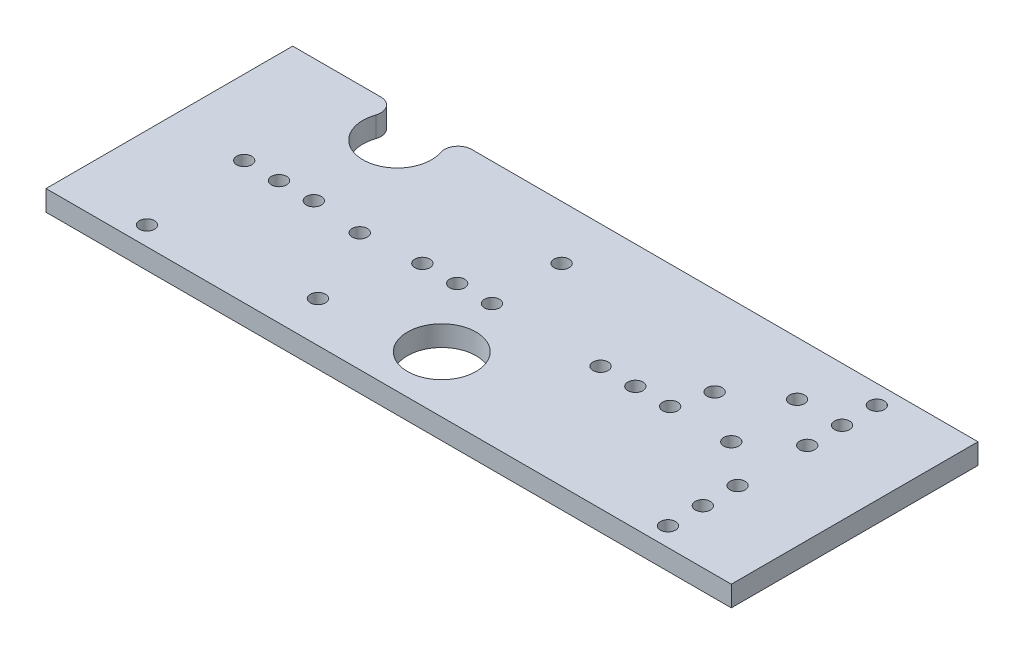
ISO-10303-21;
HEADER;
FILE_DESCRIPTION(('STEP AP214'),'2;1');
FILE_NAME('part.step','',(''),(''),'','','');
FILE_SCHEMA(('AUTOMOTIVE_DESIGN { 1 0 10303 214 1 1 1 1 }'));
ENDSEC;
DATA;
#1=APPLICATION_CONTEXT('core data for automotive mechanical design processes');
#2=APPLICATION_PROTOCOL_DEFINITION('international standard','automotive_design',2000,#1);
#3=PRODUCT_CONTEXT('',#1,'mechanical');
#4=PRODUCT('Part','Part','',(#3));
#5=PRODUCT_RELATED_PRODUCT_CATEGORY('part','',(#4));
#6=PRODUCT_DEFINITION_FORMATION('','',#4);
#7=PRODUCT_DEFINITION_CONTEXT('part definition',#1,'design');
#8=PRODUCT_DEFINITION('design','',#6,#7);
#9=PRODUCT_DEFINITION_SHAPE('','',#8);
#10=(LENGTH_UNIT() NAMED_UNIT(*) SI_UNIT(.MILLI.,.METRE.));
#11=(NAMED_UNIT(*) PLANE_ANGLE_UNIT() SI_UNIT($,.RADIAN.));
#12=(NAMED_UNIT(*) SI_UNIT($,.STERADIAN.) SOLID_ANGLE_UNIT());
#13=UNCERTAINTY_MEASURE_WITH_UNIT(LENGTH_MEASURE(1.E-05),#10,'distance_accuracy_value','');
#14=(GEOMETRIC_REPRESENTATION_CONTEXT(3) GLOBAL_UNCERTAINTY_ASSIGNED_CONTEXT((#13)) GLOBAL_UNIT_ASSIGNED_CONTEXT((#10,
#11,#12)) REPRESENTATION_CONTEXT('',''));
#15=CARTESIAN_POINT('',(0.,0.,0.));
#16=DIRECTION('',(0.,0.,1.));
#17=DIRECTION('',(1.,0.,0.));
#18=AXIS2_PLACEMENT_3D('',#15,#16,#17);
#19=CARTESIAN_POINT('',(-25.,1.5,-9.));
#20=DIRECTION('',(0.,0.,1.));
#21=DIRECTION('',(1.,0.,0.));
#22=AXIS2_PLACEMENT_3D('',#19,#20,#21);
#23=PLANE('',#22);
#24=DIRECTION('',(-1.,0.,0.));
#25=VECTOR('',#24,1.);
#26=CARTESIAN_POINT('',(-25.,0.,-9.));
#27=LINE('',#26,#25);
#28=CARTESIAN_POINT('',(25.,0.,-9.));
#29=VERTEX_POINT('',#28);
#30=CARTESIAN_POINT('',(-11.9357316041093,0.,-9.));
#31=VERTEX_POINT('',#30);
#32=EDGE_CURVE('E177',#29,#31,#27,.T.);
#33=ORIENTED_EDGE('',*,*,#32,.T.);
#34=DIRECTION('',(0.,1.,0.));
#35=VECTOR('',#34,1.);
#36=CARTESIAN_POINT('',(-11.9357316041093,1.5,-9.));
#37=LINE('',#36,#35);
#38=CARTESIAN_POINT('',(-11.9357316041093,1.5,-9.));
#39=VERTEX_POINT('',#38);
#40=EDGE_CURVE('E116',#31,#39,#37,.T.);
#41=ORIENTED_EDGE('',*,*,#40,.T.);
#42=DIRECTION('',(-1.,0.,0.));
#43=VECTOR('',#42,1.);
#44=CARTESIAN_POINT('',(-25.,1.5,-9.));
#45=LINE('',#44,#43);
#46=CARTESIAN_POINT('',(25.,1.5,-9.));
#47=VERTEX_POINT('',#46);
#48=EDGE_CURVE('E109',#47,#39,#45,.T.);
#49=ORIENTED_EDGE('',*,*,#48,.F.);
#50=DIRECTION('',(0.,-1.,0.));
#51=VECTOR('',#50,1.);
#52=CARTESIAN_POINT('',(25.,1.5,-9.));
#53=LINE('',#52,#51);
#54=EDGE_CURVE('E113',#47,#29,#53,.T.);
#55=ORIENTED_EDGE('',*,*,#54,.T.);
#56=EDGE_LOOP('',(#33,#41,#49,#55));
#57=FACE_BOUND('',#56,.T.);
#58=ADVANCED_FACE('F42',(#57),#23,.F.);
#59=CARTESIAN_POINT('',(25.,1.5,9.));
#60=DIRECTION('',(-1.,0.,0.));
#61=DIRECTION('',(0.,0.,1.));
#62=AXIS2_PLACEMENT_3D('',#59,#60,#61);
#63=PLANE('',#62);
#64=DIRECTION('',(0.,0.,-1.));
#65=VECTOR('',#64,1.);
#66=CARTESIAN_POINT('',(25.,0.,9.));
#67=LINE('',#66,#65);
#68=CARTESIAN_POINT('',(25.,0.,9.));
#69=VERTEX_POINT('',#68);
#70=EDGE_CURVE('E135',#69,#29,#67,.T.);
#71=ORIENTED_EDGE('',*,*,#70,.T.);
#72=ORIENTED_EDGE('',*,*,#54,.F.);
#73=DIRECTION('',(0.,0.,-1.));
#74=VECTOR('',#73,1.);
#75=CARTESIAN_POINT('',(25.,1.5,9.));
#76=LINE('',#75,#74);
#77=CARTESIAN_POINT('',(25.,1.5,9.));
#78=VERTEX_POINT('',#77);
#79=EDGE_CURVE('E123',#78,#47,#76,.T.);
#80=ORIENTED_EDGE('',*,*,#79,.F.);
#81=DIRECTION('',(0.,-1.,0.));
#82=VECTOR('',#81,1.);
#83=CARTESIAN_POINT('',(25.,1.5,9.));
#84=LINE('',#83,#82);
#85=EDGE_CURVE('E207',#78,#69,#84,.T.);
#86=ORIENTED_EDGE('',*,*,#85,.T.);
#87=EDGE_LOOP('',(#71,#72,#80,#86));
#88=FACE_BOUND('',#87,.T.);
#89=ADVANCED_FACE('F133',(#88),#63,.F.);
#90=CARTESIAN_POINT('',(-18.5642683958907,1.5,-9.));
#91=VERTEX_POINT('',#90);
#92=CARTESIAN_POINT('',(-25.,1.5,-9.));
#93=VERTEX_POINT('',#92);
#94=EDGE_CURVE('E120',#91,#93,#45,.T.);
#95=ORIENTED_EDGE('',*,*,#94,.F.);
#96=DIRECTION('',(0.,1.,0.));
#97=VECTOR('',#96,1.);
#98=CARTESIAN_POINT('',(-18.5642683958907,1.5,-9.));
#99=LINE('',#98,#97);
#100=CARTESIAN_POINT('',(-18.5642683958907,0.,-9.));
#101=VERTEX_POINT('',#100);
#102=EDGE_CURVE('E11',#91,#101,#99,.F.);
#103=ORIENTED_EDGE('',*,*,#102,.T.);
#104=CARTESIAN_POINT('',(-25.,0.,-9.));
#105=VERTEX_POINT('',#104);
#106=EDGE_CURVE('E182',#101,#105,#27,.T.);
#107=ORIENTED_EDGE('',*,*,#106,.T.);
#108=DIRECTION('',(0.,-1.,0.));
#109=VECTOR('',#108,1.);
#110=CARTESIAN_POINT('',(-25.,1.5,-9.));
#111=LINE('',#110,#109);
#112=EDGE_CURVE('E138',#93,#105,#111,.T.);
#113=ORIENTED_EDGE('',*,*,#112,.F.);
#114=EDGE_LOOP('',(#95,#103,#107,#113));
#115=FACE_BOUND('',#114,.T.);
#116=ADVANCED_FACE('F231',(#115),#23,.F.);
#117=CARTESIAN_POINT('',(-25.,1.5,9.));
#118=DIRECTION('',(1.,0.,0.));
#119=DIRECTION('',(0.,0.,-1.));
#120=AXIS2_PLACEMENT_3D('',#117,#118,#119);
#121=PLANE('',#120);
#122=DIRECTION('',(0.,0.,1.));
#123=VECTOR('',#122,1.);
#124=CARTESIAN_POINT('',(-25.,0.,9.));
#125=LINE('',#124,#123);
#126=CARTESIAN_POINT('',(-25.,0.,9.));
#127=VERTEX_POINT('',#126);
#128=EDGE_CURVE('E181',#105,#127,#125,.T.);
#129=ORIENTED_EDGE('',*,*,#128,.T.);
#130=DIRECTION('',(0.,-1.,0.));
#131=VECTOR('',#130,1.);
#132=CARTESIAN_POINT('',(-25.,1.5,9.));
#133=LINE('',#132,#131);
#134=CARTESIAN_POINT('',(-25.,1.5,9.));
#135=VERTEX_POINT('',#134);
#136=EDGE_CURVE('E147',#135,#127,#133,.T.);
#137=ORIENTED_EDGE('',*,*,#136,.F.);
#138=DIRECTION('',(0.,0.,1.));
#139=VECTOR('',#138,1.);
#140=CARTESIAN_POINT('',(-25.,1.5,9.));
#141=LINE('',#140,#139);
#142=EDGE_CURVE('E119',#93,#135,#141,.T.);
#143=ORIENTED_EDGE('',*,*,#142,.F.);
#144=ORIENTED_EDGE('',*,*,#112,.T.);
#145=EDGE_LOOP('',(#129,#137,#143,#144));
#146=FACE_BOUND('',#145,.T.);
#147=ADVANCED_FACE('F227',(#146),#121,.F.);
#148=CARTESIAN_POINT('',(-25.,1.5,9.));
#149=DIRECTION('',(0.,0.,-1.));
#150=DIRECTION('',(-1.,0.,0.));
#151=AXIS2_PLACEMENT_3D('',#148,#149,#150);
#152=PLANE('',#151);
#153=DIRECTION('',(1.,0.,0.));
#154=VECTOR('',#153,1.);
#155=CARTESIAN_POINT('',(-25.,0.,9.));
#156=LINE('',#155,#154);
#157=EDGE_CURVE('E131',#127,#69,#156,.T.);
#158=ORIENTED_EDGE('',*,*,#157,.T.);
#159=ORIENTED_EDGE('',*,*,#85,.F.);
#160=DIRECTION('',(1.,0.,0.));
#161=VECTOR('',#160,1.);
#162=CARTESIAN_POINT('',(-25.,1.5,9.));
#163=LINE('',#162,#161);
#164=EDGE_CURVE('E126',#135,#78,#163,.T.);
#165=ORIENTED_EDGE('',*,*,#164,.F.);
#166=ORIENTED_EDGE('',*,*,#136,.T.);
#167=EDGE_LOOP('',(#158,#159,#165,#166));
#168=FACE_BOUND('',#167,.T.);
#169=ADVANCED_FACE('F223',(#168),#152,.F.);
#170=CARTESIAN_POINT('',(0.,1.5,0.));
#171=DIRECTION('',(0.,-1.,0.));
#172=DIRECTION('',(0.,0.,-1.));
#173=AXIS2_PLACEMENT_3D('',#170,#171,#172);
#174=PLANE('',#173);
#175=CARTESIAN_POINT('',(15.7177995326955,1.5,-5.08));
#176=DIRECTION('',(0.,1.,0.));
#177=DIRECTION('',(0.,0.,1.));
#178=AXIS2_PLACEMENT_3D('',#175,#176,#177);
#179=CIRCLE('',#178,0.549999999999999);
#180=CARTESIAN_POINT('',(15.7177995326955,1.5,-4.53));
#181=VERTEX_POINT('',#180);
#182=EDGE_CURVE('E349',#181,#181,#179,.T.);
#183=ORIENTED_EDGE('',*,*,#182,.F.);
#184=EDGE_LOOP('',(#183));
#185=FACE_BOUND('',#184,.T.);
#186=CARTESIAN_POINT('',(12.2440303606406,1.5,-2.54));
#187=DIRECTION('',(0.,1.,0.));
#188=DIRECTION('',(0.,0.,1.));
#189=AXIS2_PLACEMENT_3D('',#186,#187,#188);
#190=CIRCLE('',#189,0.55);
#191=CARTESIAN_POINT('',(12.2440303606406,1.5,-1.99));
#192=VERTEX_POINT('',#191);
#193=EDGE_CURVE('E337',#192,#192,#190,.T.);
#194=ORIENTED_EDGE('',*,*,#193,.F.);
#195=EDGE_LOOP('',(#194));
#196=FACE_BOUND('',#195,.T.);
#197=CARTESIAN_POINT('',(-1.46000000000001,1.5,-5.08));
#198=DIRECTION('',(0.,1.,0.));
#199=DIRECTION('',(0.,0.,1.));
#200=AXIS2_PLACEMENT_3D('',#197,#198,#199);
#201=CIRCLE('',#200,0.55);
#202=CARTESIAN_POINT('',(-1.46000000000001,1.5,-4.53));
#203=VERTEX_POINT('',#202);
#204=EDGE_CURVE('E325',#203,#203,#201,.T.);
#205=ORIENTED_EDGE('',*,*,#204,.F.);
#206=EDGE_LOOP('',(#205));
#207=FACE_BOUND('',#206,.T.);
#208=CARTESIAN_POINT('',(-19.0140424928856,1.5,7.62));
#209=DIRECTION('',(0.,1.,0.));
#210=DIRECTION('',(0.,0.,1.));
#211=AXIS2_PLACEMENT_3D('',#208,#209,#210);
#212=CIRCLE('',#211,0.549999999999999);
#213=CARTESIAN_POINT('',(-19.0140424928856,1.5,8.17));
#214=VERTEX_POINT('',#213);
#215=EDGE_CURVE('E357',#214,#214,#212,.T.);
#216=ORIENTED_EDGE('',*,*,#215,.F.);
#217=EDGE_LOOP('',(#216));
#218=FACE_BOUND('',#217,.T.);
#219=CARTESIAN_POINT('',(-8.12911316434945,1.5,6.03308049581192));
#220=DIRECTION('',(0.,1.,0.));
#221=DIRECTION('',(0.,0.,1.));
#222=AXIS2_PLACEMENT_3D('',#219,#220,#221);
#223=CIRCLE('',#222,0.55);
#224=CARTESIAN_POINT('',(-8.12911316434945,1.5,6.58308049581192));
#225=VERTEX_POINT('',#224);
#226=EDGE_CURVE('E790',#225,#225,#223,.T.);
#227=ORIENTED_EDGE('',*,*,#226,.F.);
#228=EDGE_LOOP('',(#227));
#229=FACE_BOUND('',#228,.T.);
#230=CARTESIAN_POINT('',(-10.7569041982879,1.5,0.352285972612351));
#231=DIRECTION('',(0.,1.,0.));
#232=DIRECTION('',(0.,0.,1.));
#233=AXIS2_PLACEMENT_3D('',#230,#231,#232);
#234=CIRCLE('',#233,0.55);
#235=CARTESIAN_POINT('',(-10.7569041982879,1.5,0.902285972612351));
#236=VERTEX_POINT('',#235);
#237=EDGE_CURVE('E262',#236,#236,#234,.T.);
#238=ORIENTED_EDGE('',*,*,#237,.F.);
#239=EDGE_LOOP('',(#238));
#240=FACE_BOUND('',#239,.T.);
#241=CARTESIAN_POINT('',(19.,1.5,-7.62));
#242=DIRECTION('',(0.,1.,0.));
#243=DIRECTION('',(0.,0.,1.));
#244=AXIS2_PLACEMENT_3D('',#241,#242,#243);
#245=CIRCLE('',#244,0.549999999999999);
#246=CARTESIAN_POINT('',(19.,1.5,-7.07));
#247=VERTEX_POINT('',#246);
#248=EDGE_CURVE('E245',#247,#247,#245,.T.);
#249=ORIENTED_EDGE('',*,*,#248,.F.);
#250=EDGE_LOOP('',(#249));
#251=FACE_BOUND('',#250,.T.);
#252=CARTESIAN_POINT('',(19.,1.5,-5.08));
#253=DIRECTION('',(0.,1.,0.));
#254=DIRECTION('',(0.,0.,1.));
#255=AXIS2_PLACEMENT_3D('',#252,#253,#254);
#256=CIRCLE('',#255,0.549999999999999);
#257=CARTESIAN_POINT('',(19.,1.5,-4.53));
#258=VERTEX_POINT('',#257);
#259=EDGE_CURVE('E249',#258,#258,#256,.T.);
#260=ORIENTED_EDGE('',*,*,#259,.F.);
#261=EDGE_LOOP('',(#260));
#262=FACE_BOUND('',#261,.T.);
#263=CARTESIAN_POINT('',(19.,1.5,-2.54));
#264=DIRECTION('',(0.,1.,0.));
#265=DIRECTION('',(0.,0.,1.));
#266=AXIS2_PLACEMENT_3D('',#263,#264,#265);
#267=CIRCLE('',#266,0.549999999999999);
#268=CARTESIAN_POINT('',(19.,1.5,-1.99));
#269=VERTEX_POINT('',#268);
#270=EDGE_CURVE('E802',#269,#269,#267,.T.);
#271=ORIENTED_EDGE('',*,*,#270,.F.);
#272=EDGE_LOOP('',(#271));
#273=FACE_BOUND('',#272,.T.);
#274=CARTESIAN_POINT('',(16.,1.5,0.));
#275=DIRECTION('',(0.,1.,0.));
#276=DIRECTION('',(0.,0.,1.));
#277=AXIS2_PLACEMENT_3D('',#274,#275,#276);
#278=CIRCLE('',#277,0.549999999999999);
#279=CARTESIAN_POINT('',(16.,1.5,0.55));
#280=VERTEX_POINT('',#279);
#281=EDGE_CURVE('E361',#280,#280,#278,.T.);
#282=ORIENTED_EDGE('',*,*,#281,.F.);
#283=EDGE_LOOP('',(#282));
#284=FACE_BOUND('',#283,.T.);
#285=CARTESIAN_POINT('',(19.,1.5,2.54));
#286=DIRECTION('',(0.,1.,0.));
#287=DIRECTION('',(0.,0.,1.));
#288=AXIS2_PLACEMENT_3D('',#285,#286,#287);
#289=CIRCLE('',#288,0.549999999999999);
#290=CARTESIAN_POINT('',(19.,1.5,3.09));
#291=VERTEX_POINT('',#290);
#292=EDGE_CURVE('E373',#291,#291,#289,.T.);
#293=ORIENTED_EDGE('',*,*,#292,.F.);
#294=EDGE_LOOP('',(#293));
#295=FACE_BOUND('',#294,.T.);
#296=CARTESIAN_POINT('',(19.,1.5,5.08));
#297=DIRECTION('',(0.,1.,0.));
#298=DIRECTION('',(0.,0.,1.));
#299=AXIS2_PLACEMENT_3D('',#296,#297,#298);
#300=CIRCLE('',#299,0.549999999999999);
#301=CARTESIAN_POINT('',(19.,1.5,5.63));
#302=VERTEX_POINT('',#301);
#303=EDGE_CURVE('E383',#302,#302,#300,.T.);
#304=ORIENTED_EDGE('',*,*,#303,.F.);
#305=EDGE_LOOP('',(#304));
#306=FACE_BOUND('',#305,.T.);
#307=CARTESIAN_POINT('',(19.,1.5,7.62));
#308=DIRECTION('',(0.,1.,0.));
#309=DIRECTION('',(0.,0.,1.));
#310=AXIS2_PLACEMENT_3D('',#307,#308,#309);
#311=CIRCLE('',#310,0.549999999999999);
#312=CARTESIAN_POINT('',(19.,1.5,8.17));
#313=VERTEX_POINT('',#312);
#314=EDGE_CURVE('E392',#313,#313,#311,.T.);
#315=ORIENTED_EDGE('',*,*,#314,.F.);
#316=EDGE_LOOP('',(#315));
#317=FACE_BOUND('',#316,.T.);
#318=CARTESIAN_POINT('',(-4.00000000000001,1.5,0.));
#319=DIRECTION('',(0.,-1.,0.));
#320=DIRECTION('',(0.,0.,-1.));
#321=AXIS2_PLACEMENT_3D('',#318,#319,#320);
#322=CIRCLE('',#321,0.55);
#323=CARTESIAN_POINT('',(-4.00000000000001,1.5,-0.55));
#324=VERTEX_POINT('',#323);
#325=EDGE_CURVE('E275',#324,#324,#322,.T.);
#326=ORIENTED_EDGE('',*,*,#325,.T.);
#327=EDGE_LOOP('',(#326));
#328=FACE_BOUND('',#327,.T.);
#329=CARTESIAN_POINT('',(8.99999999999999,1.5,0.));
#330=DIRECTION('',(0.,-1.,0.));
#331=DIRECTION('',(0.,0.,-1.));
#332=AXIS2_PLACEMENT_3D('',#329,#330,#331);
#333=CIRCLE('',#332,0.55);
#334=CARTESIAN_POINT('',(8.99999999999999,1.5,-0.55));
#335=VERTEX_POINT('',#334);
#336=EDGE_CURVE('E410',#335,#335,#333,.T.);
#337=ORIENTED_EDGE('',*,*,#336,.T.);
#338=EDGE_LOOP('',(#337));
#339=FACE_BOUND('',#338,.T.);
#340=CARTESIAN_POINT('',(-19.54,1.5,0.));
#341=DIRECTION('',(0.,-1.,0.));
#342=DIRECTION('',(0.,0.,-1.));
#343=AXIS2_PLACEMENT_3D('',#340,#341,#342);
#344=CIRCLE('',#343,0.549999999999999);
#345=CARTESIAN_POINT('',(-19.54,1.5,-0.549999999999999));
#346=VERTEX_POINT('',#345);
#347=EDGE_CURVE('E417',#346,#346,#344,.T.);
#348=ORIENTED_EDGE('',*,*,#347,.T.);
#349=EDGE_LOOP('',(#348));
#350=FACE_BOUND('',#349,.T.);
#351=CARTESIAN_POINT('',(-14.46,1.5,0.));
#352=DIRECTION('',(0.,-1.,0.));
#353=DIRECTION('',(0.,0.,-1.));
#354=AXIS2_PLACEMENT_3D('',#351,#352,#353);
#355=CIRCLE('',#354,0.55);
#356=CARTESIAN_POINT('',(-14.46,1.5,-0.55));
#357=VERTEX_POINT('',#356);
#358=EDGE_CURVE('E285',#357,#357,#355,.T.);
#359=ORIENTED_EDGE('',*,*,#358,.T.);
#360=EDGE_LOOP('',(#359));
#361=FACE_BOUND('',#360,.T.);
#362=CARTESIAN_POINT('',(-6.54000000000001,1.5,0.));
#363=DIRECTION('',(0.,-1.,0.));
#364=DIRECTION('',(0.,0.,-1.));
#365=AXIS2_PLACEMENT_3D('',#362,#363,#364);
#366=CIRCLE('',#365,0.55);
#367=CARTESIAN_POINT('',(-6.54000000000001,1.5,-0.55));
#368=VERTEX_POINT('',#367);
#369=EDGE_CURVE('E286',#368,#368,#366,.T.);
#370=ORIENTED_EDGE('',*,*,#369,.T.);
#371=EDGE_LOOP('',(#370));
#372=FACE_BOUND('',#371,.T.);
#373=CARTESIAN_POINT('',(-1.46000000000001,1.5,0.));
#374=DIRECTION('',(0.,-1.,0.));
#375=DIRECTION('',(0.,0.,-1.));
#376=AXIS2_PLACEMENT_3D('',#373,#374,#375);
#377=CIRCLE('',#376,0.55);
#378=CARTESIAN_POINT('',(-1.46000000000001,1.5,-0.55));
#379=VERTEX_POINT('',#378);
#380=EDGE_CURVE('E301',#379,#379,#377,.T.);
#381=ORIENTED_EDGE('',*,*,#380,.T.);
#382=EDGE_LOOP('',(#381));
#383=FACE_BOUND('',#382,.T.);
#384=CARTESIAN_POINT('',(6.45999999999999,1.5,0.));
#385=DIRECTION('',(0.,-1.,0.));
#386=DIRECTION('',(0.,0.,-1.));
#387=AXIS2_PLACEMENT_3D('',#384,#385,#386);
#388=CIRCLE('',#387,0.55);
#389=CARTESIAN_POINT('',(6.45999999999999,1.5,-0.55));
#390=VERTEX_POINT('',#389);
#391=EDGE_CURVE('E266',#390,#390,#388,.T.);
#392=ORIENTED_EDGE('',*,*,#391,.T.);
#393=EDGE_LOOP('',(#392));
#394=FACE_BOUND('',#393,.T.);
#395=CARTESIAN_POINT('',(11.54,1.5,0.));
#396=DIRECTION('',(0.,-1.,0.));
#397=DIRECTION('',(0.,0.,-1.));
#398=AXIS2_PLACEMENT_3D('',#395,#396,#397);
#399=CIRCLE('',#398,0.55);
#400=CARTESIAN_POINT('',(11.54,1.5,-0.55));
#401=VERTEX_POINT('',#400);
#402=EDGE_CURVE('E313',#401,#401,#399,.T.);
#403=ORIENTED_EDGE('',*,*,#402,.T.);
#404=EDGE_LOOP('',(#403));
#405=FACE_BOUND('',#404,.T.);
#406=CARTESIAN_POINT('',(-17.,1.5,0.));
#407=DIRECTION('',(0.,-1.,0.));
#408=DIRECTION('',(0.,0.,-1.));
#409=AXIS2_PLACEMENT_3D('',#406,#407,#408);
#410=CIRCLE('',#409,0.549999999999999);
#411=CARTESIAN_POINT('',(-17.,1.5,-0.549999999999999));
#412=VERTEX_POINT('',#411);
#413=EDGE_CURVE('E197',#412,#412,#410,.T.);
#414=ORIENTED_EDGE('',*,*,#413,.T.);
#415=EDGE_LOOP('',(#414));
#416=FACE_BOUND('',#415,.T.);
#417=CARTESIAN_POINT('',(-0.250000000000003,1.5,4.875));
#418=DIRECTION('',(0.,1.,0.));
#419=DIRECTION('',(0.,0.,1.));
#420=AXIS2_PLACEMENT_3D('',#417,#418,#419);
#421=CIRCLE('',#420,2.5);
#422=CARTESIAN_POINT('',(-0.250000000000003,1.5,7.375));
#423=VERTEX_POINT('',#422);
#424=EDGE_CURVE('E191',#423,#423,#421,.T.);
#425=ORIENTED_EDGE('',*,*,#424,.F.);
#426=EDGE_LOOP('',(#425));
#427=FACE_BOUND('',#426,.T.);
#428=ORIENTED_EDGE('',*,*,#48,.T.);
#429=CARTESIAN_POINT('',(-11.9357316041093,1.5,-8.));
#430=DIRECTION('',(0.,-1.,0.));
#431=DIRECTION('',(0.,0.,-1.));
#432=AXIS2_PLACEMENT_3D('',#429,#430,#431);
#433=CIRCLE('',#432,1.);
#434=CARTESIAN_POINT('',(-12.8826654315066,1.5,-7.67857142857143));
#435=VERTEX_POINT('',#434);
#436=EDGE_CURVE('E161',#39,#435,#433,.F.);
#437=ORIENTED_EDGE('',*,*,#436,.T.);
#438=CARTESIAN_POINT('',(-15.25,1.5,-6.875));
#439=DIRECTION('',(0.,1.,0.));
#440=DIRECTION('',(0.,0.,1.));
#441=AXIS2_PLACEMENT_3D('',#438,#439,#440);
#442=CIRCLE('',#441,2.5);
#443=CARTESIAN_POINT('',(-17.6173345684934,1.5,-7.67857142857143));
#444=VERTEX_POINT('',#443);
#445=EDGE_CURVE('E154',#444,#435,#442,.T.);
#446=ORIENTED_EDGE('',*,*,#445,.F.);
#447=CARTESIAN_POINT('',(-18.5642683958907,1.5,-8.));
#448=DIRECTION('',(0.,-1.,0.));
#449=DIRECTION('',(0.,0.,-1.));
#450=AXIS2_PLACEMENT_3D('',#447,#448,#449);
#451=CIRCLE('',#450,1.);
#452=EDGE_CURVE('E158',#444,#91,#451,.F.);
#453=ORIENTED_EDGE('',*,*,#452,.T.);
#454=ORIENTED_EDGE('',*,*,#94,.T.);
#455=ORIENTED_EDGE('',*,*,#142,.T.);
#456=ORIENTED_EDGE('',*,*,#164,.T.);
#457=ORIENTED_EDGE('',*,*,#79,.T.);
#458=EDGE_LOOP('',(#428,#437,#446,#453,#454,#455,#456,#457));
#459=FACE_BOUND('',#458,.T.);
#460=ADVANCED_FACE('F124',(#185,#196,#207,#218,#229,#240,#251,#262,#273,#284,#295,#306,#317,
#328,#339,#350,#361,#372,#383,#394,#405,#416,#427,#459),#174,.F.);
#461=CARTESIAN_POINT('',(0.,0.,0.));
#462=DIRECTION('',(0.,-1.,0.));
#463=DIRECTION('',(0.,0.,-1.));
#464=AXIS2_PLACEMENT_3D('',#461,#462,#463);
#465=PLANE('',#464);
#466=CARTESIAN_POINT('',(15.7177995326955,0.,-5.08));
#467=DIRECTION('',(0.,1.,0.));
#468=DIRECTION('',(0.,0.,1.));
#469=AXIS2_PLACEMENT_3D('',#466,#467,#468);
#470=CIRCLE('',#469,0.549999999999999);
#471=CARTESIAN_POINT('',(15.7177995326955,0.,-4.53));
#472=VERTEX_POINT('',#471);
#473=EDGE_CURVE('E342',#472,#472,#470,.T.);
#474=ORIENTED_EDGE('',*,*,#473,.T.);
#475=EDGE_LOOP('',(#474));
#476=FACE_BOUND('',#475,.T.);
#477=CARTESIAN_POINT('',(12.2440303606406,0.,-2.54));
#478=DIRECTION('',(0.,1.,0.));
#479=DIRECTION('',(0.,0.,1.));
#480=AXIS2_PLACEMENT_3D('',#477,#478,#479);
#481=CIRCLE('',#480,0.55);
#482=CARTESIAN_POINT('',(12.2440303606406,0.,-1.99));
#483=VERTEX_POINT('',#482);
#484=EDGE_CURVE('E329',#483,#483,#481,.T.);
#485=ORIENTED_EDGE('',*,*,#484,.T.);
#486=EDGE_LOOP('',(#485));
#487=FACE_BOUND('',#486,.T.);
#488=CARTESIAN_POINT('',(-1.46000000000001,0.,-5.08));
#489=DIRECTION('',(0.,1.,0.));
#490=DIRECTION('',(0.,0.,1.));
#491=AXIS2_PLACEMENT_3D('',#488,#489,#490);
#492=CIRCLE('',#491,0.55);
#493=CARTESIAN_POINT('',(-1.46000000000001,0.,-4.53));
#494=VERTEX_POINT('',#493);
#495=EDGE_CURVE('E328',#494,#494,#492,.T.);
#496=ORIENTED_EDGE('',*,*,#495,.T.);
#497=EDGE_LOOP('',(#496));
#498=FACE_BOUND('',#497,.T.);
#499=CARTESIAN_POINT('',(-19.0140424928856,0.,7.62));
#500=DIRECTION('',(0.,1.,0.));
#501=DIRECTION('',(0.,0.,1.));
#502=AXIS2_PLACEMENT_3D('',#499,#500,#501);
#503=CIRCLE('',#502,0.549999999999999);
#504=CARTESIAN_POINT('',(-19.0140424928856,0.,8.17));
#505=VERTEX_POINT('',#504);
#506=EDGE_CURVE('E873',#505,#505,#503,.T.);
#507=ORIENTED_EDGE('',*,*,#506,.T.);
#508=EDGE_LOOP('',(#507));
#509=FACE_BOUND('',#508,.T.);
#510=CARTESIAN_POINT('',(-8.12911316434945,0.,6.03308049581192));
#511=DIRECTION('',(0.,1.,0.));
#512=DIRECTION('',(0.,0.,1.));
#513=AXIS2_PLACEMENT_3D('',#510,#511,#512);
#514=CIRCLE('',#513,0.55);
#515=CARTESIAN_POINT('',(-8.12911316434945,0.,6.58308049581192));
#516=VERTEX_POINT('',#515);
#517=EDGE_CURVE('E868',#516,#516,#514,.T.);
#518=ORIENTED_EDGE('',*,*,#517,.T.);
#519=EDGE_LOOP('',(#518));
#520=FACE_BOUND('',#519,.T.);
#521=CARTESIAN_POINT('',(-10.7569041982879,0.,0.352285972612351));
#522=DIRECTION('',(0.,1.,0.));
#523=DIRECTION('',(0.,0.,1.));
#524=AXIS2_PLACEMENT_3D('',#521,#522,#523);
#525=CIRCLE('',#524,0.55);
#526=CARTESIAN_POINT('',(-10.7569041982879,0.,0.902285972612351));
#527=VERTEX_POINT('',#526);
#528=EDGE_CURVE('E257',#527,#527,#525,.T.);
#529=ORIENTED_EDGE('',*,*,#528,.T.);
#530=EDGE_LOOP('',(#529));
#531=FACE_BOUND('',#530,.T.);
#532=CARTESIAN_POINT('',(19.,0.,-7.62));
#533=DIRECTION('',(0.,1.,0.));
#534=DIRECTION('',(0.,0.,1.));
#535=AXIS2_PLACEMENT_3D('',#532,#533,#534);
#536=CIRCLE('',#535,0.549999999999999);
#537=CARTESIAN_POINT('',(19.,0.,-7.07));
#538=VERTEX_POINT('',#537);
#539=EDGE_CURVE('E240',#538,#538,#536,.T.);
#540=ORIENTED_EDGE('',*,*,#539,.T.);
#541=EDGE_LOOP('',(#540));
#542=FACE_BOUND('',#541,.T.);
#543=CARTESIAN_POINT('',(19.,0.,-5.08));
#544=DIRECTION('',(0.,1.,0.));
#545=DIRECTION('',(0.,0.,1.));
#546=AXIS2_PLACEMENT_3D('',#543,#544,#545);
#547=CIRCLE('',#546,0.549999999999999);
#548=CARTESIAN_POINT('',(19.,0.,-4.53));
#549=VERTEX_POINT('',#548);
#550=EDGE_CURVE('E252',#549,#549,#547,.T.);
#551=ORIENTED_EDGE('',*,*,#550,.T.);
#552=EDGE_LOOP('',(#551));
#553=FACE_BOUND('',#552,.T.);
#554=CARTESIAN_POINT('',(19.,0.,-2.54));
#555=DIRECTION('',(0.,1.,0.));
#556=DIRECTION('',(0.,0.,1.));
#557=AXIS2_PLACEMENT_3D('',#554,#555,#556);
#558=CIRCLE('',#557,0.549999999999999);
#559=CARTESIAN_POINT('',(19.,0.,-1.99));
#560=VERTEX_POINT('',#559);
#561=EDGE_CURVE('E364',#560,#560,#558,.T.);
#562=ORIENTED_EDGE('',*,*,#561,.T.);
#563=EDGE_LOOP('',(#562));
#564=FACE_BOUND('',#563,.T.);
#565=CARTESIAN_POINT('',(16.,0.,0.));
#566=DIRECTION('',(0.,1.,0.));
#567=DIRECTION('',(0.,0.,1.));
#568=AXIS2_PLACEMENT_3D('',#565,#566,#567);
#569=CIRCLE('',#568,0.549999999999999);
#570=CARTESIAN_POINT('',(16.,0.,0.55));
#571=VERTEX_POINT('',#570);
#572=EDGE_CURVE('E365',#571,#571,#569,.T.);
#573=ORIENTED_EDGE('',*,*,#572,.T.);
#574=EDGE_LOOP('',(#573));
#575=FACE_BOUND('',#574,.T.);
#576=CARTESIAN_POINT('',(19.,0.,2.54));
#577=DIRECTION('',(0.,1.,0.));
#578=DIRECTION('',(0.,0.,1.));
#579=AXIS2_PLACEMENT_3D('',#576,#577,#578);
#580=CIRCLE('',#579,0.549999999999999);
#581=CARTESIAN_POINT('',(19.,0.,3.09));
#582=VERTEX_POINT('',#581);
#583=EDGE_CURVE('E378',#582,#582,#580,.T.);
#584=ORIENTED_EDGE('',*,*,#583,.T.);
#585=EDGE_LOOP('',(#584));
#586=FACE_BOUND('',#585,.T.);
#587=CARTESIAN_POINT('',(19.,0.,5.08));
#588=DIRECTION('',(0.,1.,0.));
#589=DIRECTION('',(0.,0.,1.));
#590=AXIS2_PLACEMENT_3D('',#587,#588,#589);
#591=CIRCLE('',#590,0.549999999999999);
#592=CARTESIAN_POINT('',(19.,0.,5.63));
#593=VERTEX_POINT('',#592);
#594=EDGE_CURVE('E388',#593,#593,#591,.T.);
#595=ORIENTED_EDGE('',*,*,#594,.T.);
#596=EDGE_LOOP('',(#595));
#597=FACE_BOUND('',#596,.T.);
#598=CARTESIAN_POINT('',(19.,0.,7.62));
#599=DIRECTION('',(0.,1.,0.));
#600=DIRECTION('',(0.,0.,1.));
#601=AXIS2_PLACEMENT_3D('',#598,#599,#600);
#602=CIRCLE('',#601,0.549999999999999);
#603=CARTESIAN_POINT('',(19.,0.,8.17));
#604=VERTEX_POINT('',#603);
#605=EDGE_CURVE('E261',#604,#604,#602,.T.);
#606=ORIENTED_EDGE('',*,*,#605,.T.);
#607=EDGE_LOOP('',(#606));
#608=FACE_BOUND('',#607,.T.);
#609=CARTESIAN_POINT('',(-4.00000000000001,0.,0.));
#610=DIRECTION('',(0.,-1.,0.));
#611=DIRECTION('',(0.,0.,-1.));
#612=AXIS2_PLACEMENT_3D('',#609,#610,#611);
#613=CIRCLE('',#612,0.55);
#614=CARTESIAN_POINT('',(-4.00000000000001,0.,-0.55));
#615=VERTEX_POINT('',#614);
#616=EDGE_CURVE('E278',#615,#615,#613,.T.);
#617=ORIENTED_EDGE('',*,*,#616,.F.);
#618=EDGE_LOOP('',(#617));
#619=FACE_BOUND('',#618,.T.);
#620=CARTESIAN_POINT('',(8.99999999999999,0.,0.));
#621=DIRECTION('',(0.,-1.,0.));
#622=DIRECTION('',(0.,0.,-1.));
#623=AXIS2_PLACEMENT_3D('',#620,#621,#622);
#624=CIRCLE('',#623,0.55);
#625=CARTESIAN_POINT('',(8.99999999999999,0.,-0.55));
#626=VERTEX_POINT('',#625);
#627=EDGE_CURVE('E413',#626,#626,#624,.T.);
#628=ORIENTED_EDGE('',*,*,#627,.F.);
#629=EDGE_LOOP('',(#628));
#630=FACE_BOUND('',#629,.T.);
#631=CARTESIAN_POINT('',(-19.54,0.,0.));
#632=DIRECTION('',(0.,-1.,0.));
#633=DIRECTION('',(0.,0.,-1.));
#634=AXIS2_PLACEMENT_3D('',#631,#632,#633);
#635=CIRCLE('',#634,0.549999999999999);
#636=CARTESIAN_POINT('',(-19.54,0.,-0.549999999999999));
#637=VERTEX_POINT('',#636);
#638=EDGE_CURVE('E420',#637,#637,#635,.T.);
#639=ORIENTED_EDGE('',*,*,#638,.F.);
#640=EDGE_LOOP('',(#639));
#641=FACE_BOUND('',#640,.T.);
#642=CARTESIAN_POINT('',(-14.46,0.,0.));
#643=DIRECTION('',(0.,-1.,0.));
#644=DIRECTION('',(0.,0.,-1.));
#645=AXIS2_PLACEMENT_3D('',#642,#643,#644);
#646=CIRCLE('',#645,0.55);
#647=CARTESIAN_POINT('',(-14.46,0.,-0.55));
#648=VERTEX_POINT('',#647);
#649=EDGE_CURVE('E282',#648,#648,#646,.T.);
#650=ORIENTED_EDGE('',*,*,#649,.F.);
#651=EDGE_LOOP('',(#650));
#652=FACE_BOUND('',#651,.T.);
#653=CARTESIAN_POINT('',(-6.54000000000001,0.,0.));
#654=DIRECTION('',(0.,-1.,0.));
#655=DIRECTION('',(0.,0.,-1.));
#656=AXIS2_PLACEMENT_3D('',#653,#654,#655);
#657=CIRCLE('',#656,0.55);
#658=CARTESIAN_POINT('',(-6.54000000000001,0.,-0.55));
#659=VERTEX_POINT('',#658);
#660=EDGE_CURVE('E295',#659,#659,#657,.T.);
#661=ORIENTED_EDGE('',*,*,#660,.F.);
#662=EDGE_LOOP('',(#661));
#663=FACE_BOUND('',#662,.T.);
#664=CARTESIAN_POINT('',(-1.46000000000001,0.,0.));
#665=DIRECTION('',(0.,-1.,0.));
#666=DIRECTION('',(0.,0.,-1.));
#667=AXIS2_PLACEMENT_3D('',#664,#665,#666);
#668=CIRCLE('',#667,0.55);
#669=CARTESIAN_POINT('',(-1.46000000000001,0.,-0.55));
#670=VERTEX_POINT('',#669);
#671=EDGE_CURVE('E270',#670,#670,#668,.T.);
#672=ORIENTED_EDGE('',*,*,#671,.F.);
#673=EDGE_LOOP('',(#672));
#674=FACE_BOUND('',#673,.T.);
#675=CARTESIAN_POINT('',(6.45999999999999,0.,0.));
#676=DIRECTION('',(0.,-1.,0.));
#677=DIRECTION('',(0.,0.,-1.));
#678=AXIS2_PLACEMENT_3D('',#675,#676,#677);
#679=CIRCLE('',#678,0.55);
#680=CARTESIAN_POINT('',(6.45999999999999,0.,-0.55));
#681=VERTEX_POINT('',#680);
#682=EDGE_CURVE('E271',#681,#681,#679,.T.);
#683=ORIENTED_EDGE('',*,*,#682,.F.);
#684=EDGE_LOOP('',(#683));
#685=FACE_BOUND('',#684,.T.);
#686=CARTESIAN_POINT('',(11.54,0.,0.));
#687=DIRECTION('',(0.,-1.,0.));
#688=DIRECTION('',(0.,0.,-1.));
#689=AXIS2_PLACEMENT_3D('',#686,#687,#688);
#690=CIRCLE('',#689,0.55);
#691=CARTESIAN_POINT('',(11.54,0.,-0.55));
#692=VERTEX_POINT('',#691);
#693=EDGE_CURVE('E244',#692,#692,#690,.T.);
#694=ORIENTED_EDGE('',*,*,#693,.F.);
#695=EDGE_LOOP('',(#694));
#696=FACE_BOUND('',#695,.T.);
#697=CARTESIAN_POINT('',(-17.,0.,0.));
#698=DIRECTION('',(0.,-1.,0.));
#699=DIRECTION('',(0.,0.,-1.));
#700=AXIS2_PLACEMENT_3D('',#697,#698,#699);
#701=CIRCLE('',#700,0.549999999999999);
#702=CARTESIAN_POINT('',(-17.,0.,-0.549999999999999));
#703=VERTEX_POINT('',#702);
#704=EDGE_CURVE('E200',#703,#703,#701,.T.);
#705=ORIENTED_EDGE('',*,*,#704,.F.);
#706=EDGE_LOOP('',(#705));
#707=FACE_BOUND('',#706,.T.);
#708=CARTESIAN_POINT('',(-15.25,0.,-6.875));
#709=DIRECTION('',(0.,-1.,0.));
#710=DIRECTION('',(0.,0.,-1.));
#711=AXIS2_PLACEMENT_3D('',#708,#709,#710);
#712=CIRCLE('',#711,2.5);
#713=CARTESIAN_POINT('',(-12.8826654315066,0.,-7.67857142857143));
#714=VERTEX_POINT('',#713);
#715=CARTESIAN_POINT('',(-17.6173345684934,0.,-7.67857142857143));
#716=VERTEX_POINT('',#715);
#717=EDGE_CURVE('E137',#714,#716,#712,.T.);
#718=ORIENTED_EDGE('',*,*,#717,.F.);
#719=CARTESIAN_POINT('',(-11.9357316041093,0.,-8.));
#720=DIRECTION('',(0.,-1.,0.));
#721=DIRECTION('',(0.,0.,-1.));
#722=AXIS2_PLACEMENT_3D('',#719,#720,#721);
#723=CIRCLE('',#722,1.);
#724=EDGE_CURVE('E51',#714,#31,#723,.T.);
#725=ORIENTED_EDGE('',*,*,#724,.T.);
#726=ORIENTED_EDGE('',*,*,#32,.F.);
#727=ORIENTED_EDGE('',*,*,#70,.F.);
#728=ORIENTED_EDGE('',*,*,#157,.F.);
#729=ORIENTED_EDGE('',*,*,#128,.F.);
#730=ORIENTED_EDGE('',*,*,#106,.F.);
#731=CARTESIAN_POINT('',(-18.5642683958907,0.,-8.));
#732=DIRECTION('',(0.,-1.,0.));
#733=DIRECTION('',(0.,0.,-1.));
#734=AXIS2_PLACEMENT_3D('',#731,#732,#733);
#735=CIRCLE('',#734,1.);
#736=EDGE_CURVE('E58',#101,#716,#735,.T.);
#737=ORIENTED_EDGE('',*,*,#736,.T.);
#738=EDGE_LOOP('',(#718,#725,#726,#727,#728,#729,#730,#737));
#739=FACE_BOUND('',#738,.T.);
#740=CARTESIAN_POINT('',(-0.250000000000003,0.,4.875));
#741=DIRECTION('',(0.,-1.,0.));
#742=DIRECTION('',(0.,0.,-1.));
#743=AXIS2_PLACEMENT_3D('',#740,#741,#742);
#744=CIRCLE('',#743,2.5);
#745=CARTESIAN_POINT('',(-0.250000000000003,0.,2.375));
#746=VERTEX_POINT('',#745);
#747=EDGE_CURVE('E151',#746,#746,#744,.T.);
#748=ORIENTED_EDGE('',*,*,#747,.F.);
#749=EDGE_LOOP('',(#748));
#750=FACE_BOUND('',#749,.T.);
#751=ADVANCED_FACE('F175',(#476,#487,#498,#509,#520,#531,#542,#553,#564,#575,#586,#597,#608,
#619,#630,#641,#652,#663,#674,#685,#696,#707,#739,#750),#465,.T.);
#752=CARTESIAN_POINT('',(-0.250000000000003,-8.5,4.875));
#753=DIRECTION('',(0.,1.,0.));
#754=DIRECTION('',(0.,0.,1.));
#755=AXIS2_PLACEMENT_3D('',#752,#753,#754);
#756=CYLINDRICAL_SURFACE('',#755,2.5);
#757=ORIENTED_EDGE('',*,*,#747,.T.);
#758=EDGE_LOOP('',(#757));
#759=FACE_BOUND('',#758,.T.);
#760=ORIENTED_EDGE('',*,*,#424,.T.);
#761=EDGE_LOOP('',(#760));
#762=FACE_BOUND('',#761,.T.);
#763=ADVANCED_FACE('F435',(#759,#762),#756,.F.);
#764=CARTESIAN_POINT('',(-15.25,-8.5,-6.875));
#765=DIRECTION('',(0.,1.,0.));
#766=DIRECTION('',(0.,0.,1.));
#767=AXIS2_PLACEMENT_3D('',#764,#765,#766);
#768=CYLINDRICAL_SURFACE('',#767,2.5);
#769=ORIENTED_EDGE('',*,*,#445,.T.);
#770=DIRECTION('',(0.,1.,0.));
#771=VECTOR('',#770,1.);
#772=CARTESIAN_POINT('',(-12.8826654315066,-8.5,-7.67857142857143));
#773=LINE('',#772,#771);
#774=EDGE_CURVE('E167',#435,#714,#773,.F.);
#775=ORIENTED_EDGE('',*,*,#774,.T.);
#776=ORIENTED_EDGE('',*,*,#717,.T.);
#777=DIRECTION('',(0.,1.,0.));
#778=VECTOR('',#777,1.);
#779=CARTESIAN_POINT('',(-17.6173345684934,-8.5,-7.67857142857143));
#780=LINE('',#779,#778);
#781=EDGE_CURVE('E164',#716,#444,#780,.T.);
#782=ORIENTED_EDGE('',*,*,#781,.T.);
#783=EDGE_LOOP('',(#769,#775,#776,#782));
#784=FACE_BOUND('',#783,.T.);
#785=ADVANCED_FACE('F189',(#784),#768,.F.);
#786=CARTESIAN_POINT('',(-17.,1.5,0.));
#787=DIRECTION('',(0.,-1.,0.));
#788=DIRECTION('',(0.,0.,-1.));
#789=AXIS2_PLACEMENT_3D('',#786,#787,#788);
#790=CYLINDRICAL_SURFACE('',#789,0.549999999999999);
#791=ORIENTED_EDGE('',*,*,#413,.F.);
#792=EDGE_LOOP('',(#791));
#793=FACE_BOUND('',#792,.T.);
#794=ORIENTED_EDGE('',*,*,#704,.T.);
#795=EDGE_LOOP('',(#794));
#796=FACE_BOUND('',#795,.T.);
#797=ADVANCED_FACE('F432',(#793,#796),#790,.F.);
#798=CARTESIAN_POINT('',(11.54,1.5,0.));
#799=DIRECTION('',(0.,-1.,0.));
#800=DIRECTION('',(0.,0.,-1.));
#801=AXIS2_PLACEMENT_3D('',#798,#799,#800);
#802=CYLINDRICAL_SURFACE('',#801,0.55);
#803=ORIENTED_EDGE('',*,*,#402,.F.);
#804=EDGE_LOOP('',(#803));
#805=FACE_BOUND('',#804,.T.);
#806=ORIENTED_EDGE('',*,*,#693,.T.);
#807=EDGE_LOOP('',(#806));
#808=FACE_BOUND('',#807,.T.);
#809=ADVANCED_FACE('F491',(#805,#808),#802,.F.);
#810=CARTESIAN_POINT('',(6.45999999999999,1.5,0.));
#811=DIRECTION('',(0.,-1.,0.));
#812=DIRECTION('',(0.,0.,-1.));
#813=AXIS2_PLACEMENT_3D('',#810,#811,#812);
#814=CYLINDRICAL_SURFACE('',#813,0.55);
#815=ORIENTED_EDGE('',*,*,#391,.F.);
#816=EDGE_LOOP('',(#815));
#817=FACE_BOUND('',#816,.T.);
#818=ORIENTED_EDGE('',*,*,#682,.T.);
#819=EDGE_LOOP('',(#818));
#820=FACE_BOUND('',#819,.T.);
#821=ADVANCED_FACE('F500',(#817,#820),#814,.F.);
#822=CARTESIAN_POINT('',(-1.46000000000001,1.5,0.));
#823=DIRECTION('',(0.,-1.,0.));
#824=DIRECTION('',(0.,0.,-1.));
#825=AXIS2_PLACEMENT_3D('',#822,#823,#824);
#826=CYLINDRICAL_SURFACE('',#825,0.55);
#827=ORIENTED_EDGE('',*,*,#380,.F.);
#828=EDGE_LOOP('',(#827));
#829=FACE_BOUND('',#828,.T.);
#830=ORIENTED_EDGE('',*,*,#671,.T.);
#831=EDGE_LOOP('',(#830));
#832=FACE_BOUND('',#831,.T.);
#833=ADVANCED_FACE('F509',(#829,#832),#826,.F.);
#834=CARTESIAN_POINT('',(-6.54000000000001,1.5,0.));
#835=DIRECTION('',(0.,-1.,0.));
#836=DIRECTION('',(0.,0.,-1.));
#837=AXIS2_PLACEMENT_3D('',#834,#835,#836);
#838=CYLINDRICAL_SURFACE('',#837,0.55);
#839=ORIENTED_EDGE('',*,*,#369,.F.);
#840=EDGE_LOOP('',(#839));
#841=FACE_BOUND('',#840,.T.);
#842=ORIENTED_EDGE('',*,*,#660,.T.);
#843=EDGE_LOOP('',(#842));
#844=FACE_BOUND('',#843,.T.);
#845=ADVANCED_FACE('F518',(#841,#844),#838,.F.);
#846=CARTESIAN_POINT('',(-14.46,1.5,0.));
#847=DIRECTION('',(0.,-1.,0.));
#848=DIRECTION('',(0.,0.,-1.));
#849=AXIS2_PLACEMENT_3D('',#846,#847,#848);
#850=CYLINDRICAL_SURFACE('',#849,0.55);
#851=ORIENTED_EDGE('',*,*,#358,.F.);
#852=EDGE_LOOP('',(#851));
#853=FACE_BOUND('',#852,.T.);
#854=ORIENTED_EDGE('',*,*,#649,.T.);
#855=EDGE_LOOP('',(#854));
#856=FACE_BOUND('',#855,.T.);
#857=ADVANCED_FACE('F527',(#853,#856),#850,.F.);
#858=CARTESIAN_POINT('',(-19.54,1.5,0.));
#859=DIRECTION('',(0.,-1.,0.));
#860=DIRECTION('',(0.,0.,-1.));
#861=AXIS2_PLACEMENT_3D('',#858,#859,#860);
#862=CYLINDRICAL_SURFACE('',#861,0.549999999999999);
#863=ORIENTED_EDGE('',*,*,#347,.F.);
#864=EDGE_LOOP('',(#863));
#865=FACE_BOUND('',#864,.T.);
#866=ORIENTED_EDGE('',*,*,#638,.T.);
#867=EDGE_LOOP('',(#866));
#868=FACE_BOUND('',#867,.T.);
#869=ADVANCED_FACE('F536',(#865,#868),#862,.F.);
#870=CARTESIAN_POINT('',(8.99999999999999,1.5,0.));
#871=DIRECTION('',(0.,-1.,0.));
#872=DIRECTION('',(0.,0.,-1.));
#873=AXIS2_PLACEMENT_3D('',#870,#871,#872);
#874=CYLINDRICAL_SURFACE('',#873,0.55);
#875=ORIENTED_EDGE('',*,*,#336,.F.);
#876=EDGE_LOOP('',(#875));
#877=FACE_BOUND('',#876,.T.);
#878=ORIENTED_EDGE('',*,*,#627,.T.);
#879=EDGE_LOOP('',(#878));
#880=FACE_BOUND('',#879,.T.);
#881=ADVANCED_FACE('F545',(#877,#880),#874,.F.);
#882=CARTESIAN_POINT('',(-4.00000000000001,1.5,0.));
#883=DIRECTION('',(0.,-1.,0.));
#884=DIRECTION('',(0.,0.,-1.));
#885=AXIS2_PLACEMENT_3D('',#882,#883,#884);
#886=CYLINDRICAL_SURFACE('',#885,0.55);
#887=ORIENTED_EDGE('',*,*,#325,.F.);
#888=EDGE_LOOP('',(#887));
#889=FACE_BOUND('',#888,.T.);
#890=ORIENTED_EDGE('',*,*,#616,.T.);
#891=EDGE_LOOP('',(#890));
#892=FACE_BOUND('',#891,.T.);
#893=ADVANCED_FACE('F554',(#889,#892),#886,.F.);
#894=CARTESIAN_POINT('',(19.,0.,7.62));
#895=DIRECTION('',(0.,1.,0.));
#896=DIRECTION('',(0.,0.,1.));
#897=AXIS2_PLACEMENT_3D('',#894,#895,#896);
#898=CYLINDRICAL_SURFACE('',#897,0.549999999999999);
#899=ORIENTED_EDGE('',*,*,#605,.F.);
#900=EDGE_LOOP('',(#899));
#901=FACE_BOUND('',#900,.T.);
#902=ORIENTED_EDGE('',*,*,#314,.T.);
#903=EDGE_LOOP('',(#902));
#904=FACE_BOUND('',#903,.T.);
#905=ADVANCED_FACE('F563',(#901,#904),#898,.F.);
#906=CARTESIAN_POINT('',(19.,0.,5.08));
#907=DIRECTION('',(0.,1.,0.));
#908=DIRECTION('',(0.,0.,1.));
#909=AXIS2_PLACEMENT_3D('',#906,#907,#908);
#910=CYLINDRICAL_SURFACE('',#909,0.549999999999999);
#911=ORIENTED_EDGE('',*,*,#594,.F.);
#912=EDGE_LOOP('',(#911));
#913=FACE_BOUND('',#912,.T.);
#914=ORIENTED_EDGE('',*,*,#303,.T.);
#915=EDGE_LOOP('',(#914));
#916=FACE_BOUND('',#915,.T.);
#917=ADVANCED_FACE('F572',(#913,#916),#910,.F.);
#918=CARTESIAN_POINT('',(19.,0.,2.54));
#919=DIRECTION('',(0.,1.,0.));
#920=DIRECTION('',(0.,0.,1.));
#921=AXIS2_PLACEMENT_3D('',#918,#919,#920);
#922=CYLINDRICAL_SURFACE('',#921,0.549999999999999);
#923=ORIENTED_EDGE('',*,*,#583,.F.);
#924=EDGE_LOOP('',(#923));
#925=FACE_BOUND('',#924,.T.);
#926=ORIENTED_EDGE('',*,*,#292,.T.);
#927=EDGE_LOOP('',(#926));
#928=FACE_BOUND('',#927,.T.);
#929=ADVANCED_FACE('F581',(#925,#928),#922,.F.);
#930=CARTESIAN_POINT('',(16.,0.,0.));
#931=DIRECTION('',(0.,1.,0.));
#932=DIRECTION('',(0.,0.,1.));
#933=AXIS2_PLACEMENT_3D('',#930,#931,#932);
#934=CYLINDRICAL_SURFACE('',#933,0.549999999999999);
#935=ORIENTED_EDGE('',*,*,#572,.F.);
#936=EDGE_LOOP('',(#935));
#937=FACE_BOUND('',#936,.T.);
#938=ORIENTED_EDGE('',*,*,#281,.T.);
#939=EDGE_LOOP('',(#938));
#940=FACE_BOUND('',#939,.T.);
#941=ADVANCED_FACE('F590',(#937,#940),#934,.F.);
#942=CARTESIAN_POINT('',(19.,0.,-2.54));
#943=DIRECTION('',(0.,1.,0.));
#944=DIRECTION('',(0.,0.,1.));
#945=AXIS2_PLACEMENT_3D('',#942,#943,#944);
#946=CYLINDRICAL_SURFACE('',#945,0.549999999999999);
#947=ORIENTED_EDGE('',*,*,#561,.F.);
#948=EDGE_LOOP('',(#947));
#949=FACE_BOUND('',#948,.T.);
#950=ORIENTED_EDGE('',*,*,#270,.T.);
#951=EDGE_LOOP('',(#950));
#952=FACE_BOUND('',#951,.T.);
#953=ADVANCED_FACE('F599',(#949,#952),#946,.F.);
#954=CARTESIAN_POINT('',(19.,0.,-5.08));
#955=DIRECTION('',(0.,1.,0.));
#956=DIRECTION('',(0.,0.,1.));
#957=AXIS2_PLACEMENT_3D('',#954,#955,#956);
#958=CYLINDRICAL_SURFACE('',#957,0.549999999999999);
#959=ORIENTED_EDGE('',*,*,#550,.F.);
#960=EDGE_LOOP('',(#959));
#961=FACE_BOUND('',#960,.T.);
#962=ORIENTED_EDGE('',*,*,#259,.T.);
#963=EDGE_LOOP('',(#962));
#964=FACE_BOUND('',#963,.T.);
#965=ADVANCED_FACE('F608',(#961,#964),#958,.F.);
#966=CARTESIAN_POINT('',(19.,0.,-7.62));
#967=DIRECTION('',(0.,1.,0.));
#968=DIRECTION('',(0.,0.,1.));
#969=AXIS2_PLACEMENT_3D('',#966,#967,#968);
#970=CYLINDRICAL_SURFACE('',#969,0.549999999999999);
#971=ORIENTED_EDGE('',*,*,#539,.F.);
#972=EDGE_LOOP('',(#971));
#973=FACE_BOUND('',#972,.T.);
#974=ORIENTED_EDGE('',*,*,#248,.T.);
#975=EDGE_LOOP('',(#974));
#976=FACE_BOUND('',#975,.T.);
#977=ADVANCED_FACE('F617',(#973,#976),#970,.F.);
#978=CARTESIAN_POINT('',(-10.7569041982879,0.,0.352285972612351));
#979=DIRECTION('',(0.,1.,0.));
#980=DIRECTION('',(0.,0.,1.));
#981=AXIS2_PLACEMENT_3D('',#978,#979,#980);
#982=CYLINDRICAL_SURFACE('',#981,0.55);
#983=ORIENTED_EDGE('',*,*,#528,.F.);
#984=EDGE_LOOP('',(#983));
#985=FACE_BOUND('',#984,.T.);
#986=ORIENTED_EDGE('',*,*,#237,.T.);
#987=EDGE_LOOP('',(#986));
#988=FACE_BOUND('',#987,.T.);
#989=ADVANCED_FACE('F626',(#985,#988),#982,.F.);
#990=CARTESIAN_POINT('',(-8.12911316434945,0.,6.03308049581192));
#991=DIRECTION('',(0.,1.,0.));
#992=DIRECTION('',(0.,0.,1.));
#993=AXIS2_PLACEMENT_3D('',#990,#991,#992);
#994=CYLINDRICAL_SURFACE('',#993,0.55);
#995=ORIENTED_EDGE('',*,*,#517,.F.);
#996=EDGE_LOOP('',(#995));
#997=FACE_BOUND('',#996,.T.);
#998=ORIENTED_EDGE('',*,*,#226,.T.);
#999=EDGE_LOOP('',(#998));
#1000=FACE_BOUND('',#999,.T.);
#1001=ADVANCED_FACE('F635',(#997,#1000),#994,.F.);
#1002=CARTESIAN_POINT('',(-19.0140424928856,0.,7.62));
#1003=DIRECTION('',(0.,1.,0.));
#1004=DIRECTION('',(0.,0.,1.));
#1005=AXIS2_PLACEMENT_3D('',#1002,#1003,#1004);
#1006=CYLINDRICAL_SURFACE('',#1005,0.549999999999999);
#1007=ORIENTED_EDGE('',*,*,#506,.F.);
#1008=EDGE_LOOP('',(#1007));
#1009=FACE_BOUND('',#1008,.T.);
#1010=ORIENTED_EDGE('',*,*,#215,.T.);
#1011=EDGE_LOOP('',(#1010));
#1012=FACE_BOUND('',#1011,.T.);
#1013=ADVANCED_FACE('F644',(#1009,#1012),#1006,.F.);
#1014=CARTESIAN_POINT('',(-1.46000000000001,0.,-5.08));
#1015=DIRECTION('',(0.,1.,0.));
#1016=DIRECTION('',(0.,0.,1.));
#1017=AXIS2_PLACEMENT_3D('',#1014,#1015,#1016);
#1018=CYLINDRICAL_SURFACE('',#1017,0.55);
#1019=ORIENTED_EDGE('',*,*,#495,.F.);
#1020=EDGE_LOOP('',(#1019));
#1021=FACE_BOUND('',#1020,.T.);
#1022=ORIENTED_EDGE('',*,*,#204,.T.);
#1023=EDGE_LOOP('',(#1022));
#1024=FACE_BOUND('',#1023,.T.);
#1025=ADVANCED_FACE('F653',(#1021,#1024),#1018,.F.);
#1026=CARTESIAN_POINT('',(12.2440303606406,0.,-2.54));
#1027=DIRECTION('',(0.,1.,0.));
#1028=DIRECTION('',(0.,0.,1.));
#1029=AXIS2_PLACEMENT_3D('',#1026,#1027,#1028);
#1030=CYLINDRICAL_SURFACE('',#1029,0.55);
#1031=ORIENTED_EDGE('',*,*,#484,.F.);
#1032=EDGE_LOOP('',(#1031));
#1033=FACE_BOUND('',#1032,.T.);
#1034=ORIENTED_EDGE('',*,*,#193,.T.);
#1035=EDGE_LOOP('',(#1034));
#1036=FACE_BOUND('',#1035,.T.);
#1037=ADVANCED_FACE('F662',(#1033,#1036),#1030,.F.);
#1038=CARTESIAN_POINT('',(15.7177995326955,0.,-5.08));
#1039=DIRECTION('',(0.,1.,0.));
#1040=DIRECTION('',(0.,0.,1.));
#1041=AXIS2_PLACEMENT_3D('',#1038,#1039,#1040);
#1042=CYLINDRICAL_SURFACE('',#1041,0.549999999999999);
#1043=ORIENTED_EDGE('',*,*,#473,.F.);
#1044=EDGE_LOOP('',(#1043));
#1045=FACE_BOUND('',#1044,.T.);
#1046=ORIENTED_EDGE('',*,*,#182,.T.);
#1047=EDGE_LOOP('',(#1046));
#1048=FACE_BOUND('',#1047,.T.);
#1049=ADVANCED_FACE('F671',(#1045,#1048),#1042,.F.);
#1050=CARTESIAN_POINT('',(-11.9357316041093,-8.5,-8.));
#1051=DIRECTION('',(0.,1.,0.));
#1052=DIRECTION('',(0.,0.,1.));
#1053=AXIS2_PLACEMENT_3D('',#1050,#1051,#1052);
#1054=CYLINDRICAL_SURFACE('',#1053,1.);
#1055=ORIENTED_EDGE('',*,*,#724,.F.);
#1056=ORIENTED_EDGE('',*,*,#774,.F.);
#1057=ORIENTED_EDGE('',*,*,#436,.F.);
#1058=ORIENTED_EDGE('',*,*,#40,.F.);
#1059=EDGE_LOOP('',(#1055,#1056,#1057,#1058));
#1060=FACE_BOUND('',#1059,.T.);
#1061=ADVANCED_FACE('F184',(#1060),#1054,.T.);
#1062=CARTESIAN_POINT('',(-18.5642683958907,-8.5,-8.));
#1063=DIRECTION('',(0.,1.,0.));
#1064=DIRECTION('',(0.,0.,1.));
#1065=AXIS2_PLACEMENT_3D('',#1062,#1063,#1064);
#1066=CYLINDRICAL_SURFACE('',#1065,1.);
#1067=ORIENTED_EDGE('',*,*,#452,.F.);
#1068=ORIENTED_EDGE('',*,*,#781,.F.);
#1069=ORIENTED_EDGE('',*,*,#736,.F.);
#1070=ORIENTED_EDGE('',*,*,#102,.F.);
#1071=EDGE_LOOP('',(#1067,#1068,#1069,#1070));
#1072=FACE_BOUND('',#1071,.T.);
#1073=ADVANCED_FACE('F44',(#1072),#1066,.T.);
#1074=CLOSED_SHELL('',(#58,#89,#116,#147,#169,#460,#751,#763,#785,#797,#809,#821,#833,#845,#857,
#869,#881,#893,#905,#917,#929,#941,#953,#965,#977,#989,#1001,#1013,#1025,#1037,#1049,#1061,#1073));
#1075=MANIFOLD_SOLID_BREP('B2',#1074);
#1076=ADVANCED_BREP_SHAPE_REPRESENTATION('',(#18,#1075),#14);
#1077=SHAPE_DEFINITION_REPRESENTATION(#9,#1076);
ENDSEC;
END-ISO-10303-21;
